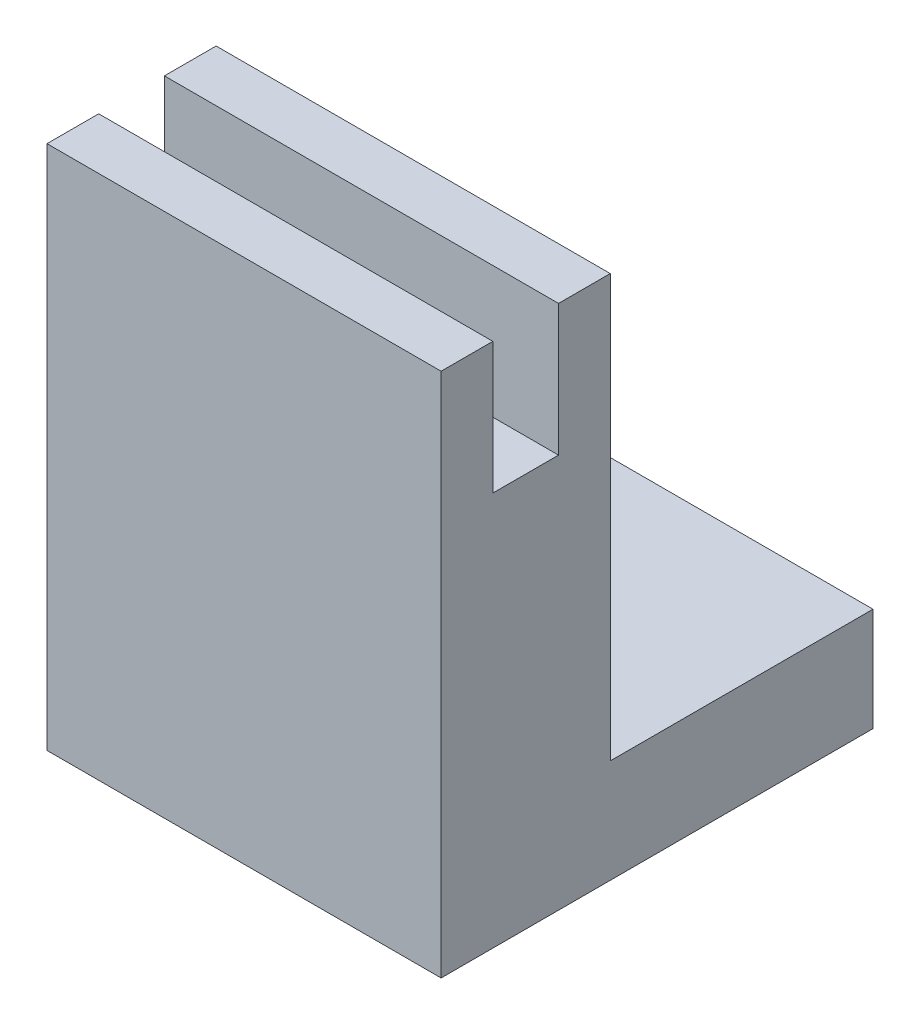
ISO-10303-21;
HEADER;
FILE_DESCRIPTION(('STEP AP214'),'2;1');
FILE_NAME('part.step','',(''),(''),'','','');
FILE_SCHEMA(('AUTOMOTIVE_DESIGN { 1 0 10303 214 1 1 1 1 }'));
ENDSEC;
DATA;
#1=APPLICATION_CONTEXT('core data for automotive mechanical design processes');
#2=APPLICATION_PROTOCOL_DEFINITION('international standard','automotive_design',2000,#1);
#3=PRODUCT_CONTEXT('',#1,'mechanical');
#4=PRODUCT('Part','Part','',(#3));
#5=PRODUCT_RELATED_PRODUCT_CATEGORY('part','',(#4));
#6=PRODUCT_DEFINITION_FORMATION('','',#4);
#7=PRODUCT_DEFINITION_CONTEXT('part definition',#1,'design');
#8=PRODUCT_DEFINITION('design','',#6,#7);
#9=PRODUCT_DEFINITION_SHAPE('','',#8);
#10=(LENGTH_UNIT() NAMED_UNIT(*) SI_UNIT(.MILLI.,.METRE.));
#11=(NAMED_UNIT(*) PLANE_ANGLE_UNIT() SI_UNIT($,.RADIAN.));
#12=(NAMED_UNIT(*) SI_UNIT($,.STERADIAN.) SOLID_ANGLE_UNIT());
#13=UNCERTAINTY_MEASURE_WITH_UNIT(LENGTH_MEASURE(1.E-05),#10,'distance_accuracy_value','');
#14=(GEOMETRIC_REPRESENTATION_CONTEXT(3) GLOBAL_UNCERTAINTY_ASSIGNED_CONTEXT((#13)) GLOBAL_UNIT_ASSIGNED_CONTEXT((#10,
#11,#12)) REPRESENTATION_CONTEXT('',''));
#15=CARTESIAN_POINT('',(0.,0.,0.));
#16=DIRECTION('',(0.,0.,1.));
#17=DIRECTION('',(1.,0.,0.));
#18=AXIS2_PLACEMENT_3D('',#15,#16,#17);
#19=CARTESIAN_POINT('',(38.1,50.8,0.));
#20=DIRECTION('',(0.,0.,-1.));
#21=DIRECTION('',(0.,1.,0.));
#22=AXIS2_PLACEMENT_3D('',#19,#20,#21);
#23=PLANE('',#22);
#24=DIRECTION('',(0.,-1.,0.));
#25=VECTOR('',#24,1.);
#26=CARTESIAN_POINT('',(0.,50.8,0.));
#27=LINE('',#26,#25);
#28=CARTESIAN_POINT('',(0.,50.8,0.));
#29=VERTEX_POINT('',#28);
#30=CARTESIAN_POINT('',(0.,0.,0.));
#31=VERTEX_POINT('',#30);
#32=EDGE_CURVE('E143',#29,#31,#27,.T.);
#33=ORIENTED_EDGE('',*,*,#32,.T.);
#34=DIRECTION('',(-1.,0.,0.));
#35=VECTOR('',#34,1.);
#36=CARTESIAN_POINT('',(38.1,0.,0.));
#37=LINE('',#36,#35);
#38=CARTESIAN_POINT('',(38.1,0.,0.));
#39=VERTEX_POINT('',#38);
#40=EDGE_CURVE('E11',#39,#31,#37,.T.);
#41=ORIENTED_EDGE('',*,*,#40,.F.);
#42=DIRECTION('',(0.,-1.,0.));
#43=VECTOR('',#42,1.);
#44=CARTESIAN_POINT('',(38.1,50.8,0.));
#45=LINE('',#44,#43);
#46=CARTESIAN_POINT('',(38.1,50.8,0.));
#47=VERTEX_POINT('',#46);
#48=EDGE_CURVE('E161',#47,#39,#45,.T.);
#49=ORIENTED_EDGE('',*,*,#48,.F.);
#50=DIRECTION('',(-1.,0.,0.));
#51=VECTOR('',#50,1.);
#52=CARTESIAN_POINT('',(38.1,50.8,0.));
#53=LINE('',#52,#51);
#54=EDGE_CURVE('E139',#47,#29,#53,.T.);
#55=ORIENTED_EDGE('',*,*,#54,.T.);
#56=EDGE_LOOP('',(#33,#41,#49,#55));
#57=FACE_BOUND('',#56,.T.);
#58=ADVANCED_FACE('F35',(#57),#23,.F.);
#59=CARTESIAN_POINT('',(38.1,0.,0.));
#60=DIRECTION('',(0.,1.,0.));
#61=DIRECTION('',(0.,0.,1.));
#62=AXIS2_PLACEMENT_3D('',#59,#60,#61);
#63=PLANE('',#62);
#64=DIRECTION('',(0.,0.,-1.));
#65=VECTOR('',#64,1.);
#66=CARTESIAN_POINT('',(0.,0.,0.));
#67=LINE('',#66,#65);
#68=CARTESIAN_POINT('',(0.,0.,-41.75));
#69=VERTEX_POINT('',#68);
#70=EDGE_CURVE('E146',#31,#69,#67,.T.);
#71=ORIENTED_EDGE('',*,*,#70,.T.);
#72=DIRECTION('',(-1.,0.,0.));
#73=VECTOR('',#72,1.);
#74=CARTESIAN_POINT('',(38.1,0.,-41.75));
#75=LINE('',#74,#73);
#76=CARTESIAN_POINT('',(38.1,0.,-41.75));
#77=VERTEX_POINT('',#76);
#78=EDGE_CURVE('E43',#77,#69,#75,.T.);
#79=ORIENTED_EDGE('',*,*,#78,.F.);
#80=DIRECTION('',(0.,0.,-1.));
#81=VECTOR('',#80,1.);
#82=CARTESIAN_POINT('',(38.1,0.,0.));
#83=LINE('',#82,#81);
#84=EDGE_CURVE('E100',#39,#77,#83,.T.);
#85=ORIENTED_EDGE('',*,*,#84,.F.);
#86=ORIENTED_EDGE('',*,*,#40,.T.);
#87=EDGE_LOOP('',(#71,#79,#85,#86));
#88=FACE_BOUND('',#87,.T.);
#89=ADVANCED_FACE('F210',(#88),#63,.F.);
#90=CARTESIAN_POINT('',(38.1,0.,-41.75));
#91=DIRECTION('',(0.,0.,1.));
#92=DIRECTION('',(1.,0.,0.));
#93=AXIS2_PLACEMENT_3D('',#90,#91,#92);
#94=PLANE('',#93);
#95=DIRECTION('',(0.,1.,0.));
#96=VECTOR('',#95,1.);
#97=CARTESIAN_POINT('',(0.,0.,-41.75));
#98=LINE('',#97,#96);
#99=CARTESIAN_POINT('',(0.,9.99999999999999,-41.75));
#100=VERTEX_POINT('',#99);
#101=EDGE_CURVE('E148',#69,#100,#98,.T.);
#102=ORIENTED_EDGE('',*,*,#101,.T.);
#103=DIRECTION('',(-1.,0.,0.));
#104=VECTOR('',#103,1.);
#105=CARTESIAN_POINT('',(38.1,9.99999999999999,-41.75));
#106=LINE('',#105,#104);
#107=CARTESIAN_POINT('',(38.1,9.99999999999999,-41.75));
#108=VERTEX_POINT('',#107);
#109=EDGE_CURVE('E174',#108,#100,#106,.T.);
#110=ORIENTED_EDGE('',*,*,#109,.F.);
#111=DIRECTION('',(0.,1.,0.));
#112=VECTOR('',#111,1.);
#113=CARTESIAN_POINT('',(38.1,0.,-41.75));
#114=LINE('',#113,#112);
#115=EDGE_CURVE('E182',#77,#108,#114,.T.);
#116=ORIENTED_EDGE('',*,*,#115,.F.);
#117=ORIENTED_EDGE('',*,*,#78,.T.);
#118=EDGE_LOOP('',(#102,#110,#116,#117));
#119=FACE_BOUND('',#118,.T.);
#120=ADVANCED_FACE('F180',(#119),#94,.F.);
#121=CARTESIAN_POINT('',(38.1,9.99999999999999,-41.75));
#122=DIRECTION('',(0.,-1.,0.));
#123=DIRECTION('',(0.,0.,-1.));
#124=AXIS2_PLACEMENT_3D('',#121,#122,#123);
#125=PLANE('',#124);
#126=DIRECTION('',(0.,0.,1.));
#127=VECTOR('',#126,1.);
#128=CARTESIAN_POINT('',(0.,9.99999999999999,-41.75));
#129=LINE('',#128,#127);
#130=CARTESIAN_POINT('',(0.,9.99999999999999,-16.35));
#131=VERTEX_POINT('',#130);
#132=EDGE_CURVE('E150',#100,#131,#129,.T.);
#133=ORIENTED_EDGE('',*,*,#132,.T.);
#134=DIRECTION('',(-1.,0.,0.));
#135=VECTOR('',#134,1.);
#136=CARTESIAN_POINT('',(38.1,9.99999999999999,-16.35));
#137=LINE('',#136,#135);
#138=CARTESIAN_POINT('',(38.1,9.99999999999999,-16.35));
#139=VERTEX_POINT('',#138);
#140=EDGE_CURVE('E171',#139,#131,#137,.T.);
#141=ORIENTED_EDGE('',*,*,#140,.F.);
#142=DIRECTION('',(0.,0.,1.));
#143=VECTOR('',#142,1.);
#144=CARTESIAN_POINT('',(38.1,9.99999999999999,-41.75));
#145=LINE('',#144,#143);
#146=EDGE_CURVE('E200',#108,#139,#145,.T.);
#147=ORIENTED_EDGE('',*,*,#146,.F.);
#148=ORIENTED_EDGE('',*,*,#109,.T.);
#149=EDGE_LOOP('',(#133,#141,#147,#148));
#150=FACE_BOUND('',#149,.T.);
#151=ADVANCED_FACE('F191',(#150),#125,.F.);
#152=CARTESIAN_POINT('',(38.1,9.99999999999999,-16.35));
#153=DIRECTION('',(0.,0.,1.));
#154=DIRECTION('',(1.,0.,0.));
#155=AXIS2_PLACEMENT_3D('',#152,#153,#154);
#156=PLANE('',#155);
#157=DIRECTION('',(0.,1.,0.));
#158=VECTOR('',#157,1.);
#159=CARTESIAN_POINT('',(0.,9.99999999999999,-16.35));
#160=LINE('',#159,#158);
#161=CARTESIAN_POINT('',(0.,50.8,-16.35));
#162=VERTEX_POINT('',#161);
#163=EDGE_CURVE('E152',#131,#162,#160,.T.);
#164=ORIENTED_EDGE('',*,*,#163,.T.);
#165=DIRECTION('',(-1.,0.,0.));
#166=VECTOR('',#165,1.);
#167=CARTESIAN_POINT('',(38.1,50.8,-16.35));
#168=LINE('',#167,#166);
#169=CARTESIAN_POINT('',(38.1,50.8,-16.35));
#170=VERTEX_POINT('',#169);
#171=EDGE_CURVE('E168',#170,#162,#168,.T.);
#172=ORIENTED_EDGE('',*,*,#171,.F.);
#173=DIRECTION('',(0.,1.,0.));
#174=VECTOR('',#173,1.);
#175=CARTESIAN_POINT('',(38.1,9.99999999999999,-16.35));
#176=LINE('',#175,#174);
#177=EDGE_CURVE('E197',#139,#170,#176,.T.);
#178=ORIENTED_EDGE('',*,*,#177,.F.);
#179=ORIENTED_EDGE('',*,*,#140,.T.);
#180=EDGE_LOOP('',(#164,#172,#178,#179));
#181=FACE_BOUND('',#180,.T.);
#182=ADVANCED_FACE('F195',(#181),#156,.F.);
#183=CARTESIAN_POINT('',(38.1,50.8,-16.35));
#184=DIRECTION('',(0.,-1.,0.));
#185=DIRECTION('',(0.,0.,-1.));
#186=AXIS2_PLACEMENT_3D('',#183,#184,#185);
#187=PLANE('',#186);
#188=DIRECTION('',(0.,0.,1.));
#189=VECTOR('',#188,1.);
#190=CARTESIAN_POINT('',(0.,50.8,-16.35));
#191=LINE('',#190,#189);
#192=CARTESIAN_POINT('',(0.,50.8,-11.35));
#193=VERTEX_POINT('',#192);
#194=EDGE_CURVE('E154',#162,#193,#191,.T.);
#195=ORIENTED_EDGE('',*,*,#194,.T.);
#196=DIRECTION('',(-1.,0.,0.));
#197=VECTOR('',#196,1.);
#198=CARTESIAN_POINT('',(38.1,50.8,-11.35));
#199=LINE('',#198,#197);
#200=CARTESIAN_POINT('',(38.1,50.8,-11.35));
#201=VERTEX_POINT('',#200);
#202=EDGE_CURVE('E165',#201,#193,#199,.T.);
#203=ORIENTED_EDGE('',*,*,#202,.F.);
#204=DIRECTION('',(0.,0.,1.));
#205=VECTOR('',#204,1.);
#206=CARTESIAN_POINT('',(38.1,50.8,-16.35));
#207=LINE('',#206,#205);
#208=EDGE_CURVE('E199',#170,#201,#207,.T.);
#209=ORIENTED_EDGE('',*,*,#208,.F.);
#210=ORIENTED_EDGE('',*,*,#171,.T.);
#211=EDGE_LOOP('',(#195,#203,#209,#210));
#212=FACE_BOUND('',#211,.T.);
#213=ADVANCED_FACE('F222',(#212),#187,.F.);
#214=CARTESIAN_POINT('',(38.1,50.8,-11.35));
#215=DIRECTION('',(0.,0.,-1.));
#216=DIRECTION('',(0.,1.,0.));
#217=AXIS2_PLACEMENT_3D('',#214,#215,#216);
#218=PLANE('',#217);
#219=DIRECTION('',(0.,-1.,0.));
#220=VECTOR('',#219,1.);
#221=CARTESIAN_POINT('',(0.,50.8,-11.35));
#222=LINE('',#221,#220);
#223=CARTESIAN_POINT('',(0.,38.1,-11.35));
#224=VERTEX_POINT('',#223);
#225=EDGE_CURVE('E156',#193,#224,#222,.T.);
#226=ORIENTED_EDGE('',*,*,#225,.T.);
#227=DIRECTION('',(-1.,0.,0.));
#228=VECTOR('',#227,1.);
#229=CARTESIAN_POINT('',(38.1,38.1,-11.35));
#230=LINE('',#229,#228);
#231=CARTESIAN_POINT('',(38.1,38.1,-11.35));
#232=VERTEX_POINT('',#231);
#233=EDGE_CURVE('E134',#232,#224,#230,.T.);
#234=ORIENTED_EDGE('',*,*,#233,.F.);
#235=DIRECTION('',(0.,-1.,0.));
#236=VECTOR('',#235,1.);
#237=CARTESIAN_POINT('',(38.1,50.8,-11.35));
#238=LINE('',#237,#236);
#239=EDGE_CURVE('E125',#201,#232,#238,.T.);
#240=ORIENTED_EDGE('',*,*,#239,.F.);
#241=ORIENTED_EDGE('',*,*,#202,.T.);
#242=EDGE_LOOP('',(#226,#234,#240,#241));
#243=FACE_BOUND('',#242,.T.);
#244=ADVANCED_FACE('F225',(#243),#218,.F.);
#245=CARTESIAN_POINT('',(38.1,38.1,-11.35));
#246=DIRECTION('',(0.,-1.,0.));
#247=DIRECTION('',(0.,0.,-1.));
#248=AXIS2_PLACEMENT_3D('',#245,#246,#247);
#249=PLANE('',#248);
#250=DIRECTION('',(0.,0.,1.));
#251=VECTOR('',#250,1.);
#252=CARTESIAN_POINT('',(0.,38.1,-11.35));
#253=LINE('',#252,#251);
#254=CARTESIAN_POINT('',(0.,38.1,-4.99999999999999));
#255=VERTEX_POINT('',#254);
#256=EDGE_CURVE('E133',#224,#255,#253,.T.);
#257=ORIENTED_EDGE('',*,*,#256,.T.);
#258=DIRECTION('',(-1.,0.,0.));
#259=VECTOR('',#258,1.);
#260=CARTESIAN_POINT('',(38.1,38.1,-4.99999999999999));
#261=LINE('',#260,#259);
#262=CARTESIAN_POINT('',(38.1,38.1,-4.99999999999999));
#263=VERTEX_POINT('',#262);
#264=EDGE_CURVE('E130',#263,#255,#261,.T.);
#265=ORIENTED_EDGE('',*,*,#264,.F.);
#266=DIRECTION('',(0.,0.,1.));
#267=VECTOR('',#266,1.);
#268=CARTESIAN_POINT('',(38.1,38.1,-11.35));
#269=LINE('',#268,#267);
#270=EDGE_CURVE('E119',#232,#263,#269,.T.);
#271=ORIENTED_EDGE('',*,*,#270,.F.);
#272=ORIENTED_EDGE('',*,*,#233,.T.);
#273=EDGE_LOOP('',(#257,#265,#271,#272));
#274=FACE_BOUND('',#273,.T.);
#275=ADVANCED_FACE('F131',(#274),#249,.F.);
#276=CARTESIAN_POINT('',(38.1,38.1,-4.99999999999999));
#277=DIRECTION('',(0.,0.,1.));
#278=DIRECTION('',(0.,-1.,0.));
#279=AXIS2_PLACEMENT_3D('',#276,#277,#278);
#280=PLANE('',#279);
#281=DIRECTION('',(0.,1.,0.));
#282=VECTOR('',#281,1.);
#283=CARTESIAN_POINT('',(0.,38.1,-4.99999999999999));
#284=LINE('',#283,#282);
#285=CARTESIAN_POINT('',(0.,50.8,-4.99999999999999));
#286=VERTEX_POINT('',#285);
#287=EDGE_CURVE('E86',#255,#286,#284,.T.);
#288=ORIENTED_EDGE('',*,*,#287,.T.);
#289=DIRECTION('',(-1.,0.,0.));
#290=VECTOR('',#289,1.);
#291=CARTESIAN_POINT('',(38.1,50.8,-4.99999999999999));
#292=LINE('',#291,#290);
#293=CARTESIAN_POINT('',(38.1,50.8,-4.99999999999999));
#294=VERTEX_POINT('',#293);
#295=EDGE_CURVE('E135',#294,#286,#292,.T.);
#296=ORIENTED_EDGE('',*,*,#295,.F.);
#297=DIRECTION('',(0.,1.,0.));
#298=VECTOR('',#297,1.);
#299=CARTESIAN_POINT('',(38.1,38.1,-4.99999999999999));
#300=LINE('',#299,#298);
#301=EDGE_CURVE('E123',#263,#294,#300,.T.);
#302=ORIENTED_EDGE('',*,*,#301,.F.);
#303=ORIENTED_EDGE('',*,*,#264,.T.);
#304=EDGE_LOOP('',(#288,#296,#302,#303));
#305=FACE_BOUND('',#304,.T.);
#306=ADVANCED_FACE('F137',(#305),#280,.F.);
#307=CARTESIAN_POINT('',(38.1,50.8,-4.99999999999999));
#308=DIRECTION('',(0.,-1.,0.));
#309=DIRECTION('',(0.,0.,-1.));
#310=AXIS2_PLACEMENT_3D('',#307,#308,#309);
#311=PLANE('',#310);
#312=DIRECTION('',(0.,0.,1.));
#313=VECTOR('',#312,1.);
#314=CARTESIAN_POINT('',(0.,50.8,-4.99999999999999));
#315=LINE('',#314,#313);
#316=EDGE_CURVE('E92',#286,#29,#315,.T.);
#317=ORIENTED_EDGE('',*,*,#316,.T.);
#318=ORIENTED_EDGE('',*,*,#54,.F.);
#319=DIRECTION('',(0.,0.,1.));
#320=VECTOR('',#319,1.);
#321=CARTESIAN_POINT('',(38.1,50.8,-4.99999999999999));
#322=LINE('',#321,#320);
#323=EDGE_CURVE('E51',#294,#47,#322,.T.);
#324=ORIENTED_EDGE('',*,*,#323,.F.);
#325=ORIENTED_EDGE('',*,*,#295,.T.);
#326=EDGE_LOOP('',(#317,#318,#324,#325));
#327=FACE_BOUND('',#326,.T.);
#328=ADVANCED_FACE('F234',(#327),#311,.F.);
#329=CARTESIAN_POINT('',(38.1,0.,0.));
#330=DIRECTION('',(1.,0.,0.));
#331=DIRECTION('',(0.,0.,-1.));
#332=AXIS2_PLACEMENT_3D('',#329,#330,#331);
#333=PLANE('',#332);
#334=ORIENTED_EDGE('',*,*,#48,.T.);
#335=ORIENTED_EDGE('',*,*,#84,.T.);
#336=ORIENTED_EDGE('',*,*,#115,.T.);
#337=ORIENTED_EDGE('',*,*,#146,.T.);
#338=ORIENTED_EDGE('',*,*,#177,.T.);
#339=ORIENTED_EDGE('',*,*,#208,.T.);
#340=ORIENTED_EDGE('',*,*,#239,.T.);
#341=ORIENTED_EDGE('',*,*,#270,.T.);
#342=ORIENTED_EDGE('',*,*,#301,.T.);
#343=ORIENTED_EDGE('',*,*,#323,.T.);
#344=EDGE_LOOP('',(#334,#335,#336,#337,#338,#339,#340,#341,#342,#343));
#345=FACE_BOUND('',#344,.T.);
#346=ADVANCED_FACE('F121',(#345),#333,.T.);
#347=CARTESIAN_POINT('',(0.,0.,0.));
#348=DIRECTION('',(1.,0.,0.));
#349=DIRECTION('',(0.,0.,-1.));
#350=AXIS2_PLACEMENT_3D('',#347,#348,#349);
#351=PLANE('',#350);
#352=ORIENTED_EDGE('',*,*,#32,.F.);
#353=ORIENTED_EDGE('',*,*,#316,.F.);
#354=ORIENTED_EDGE('',*,*,#287,.F.);
#355=ORIENTED_EDGE('',*,*,#256,.F.);
#356=ORIENTED_EDGE('',*,*,#225,.F.);
#357=ORIENTED_EDGE('',*,*,#194,.F.);
#358=ORIENTED_EDGE('',*,*,#163,.F.);
#359=ORIENTED_EDGE('',*,*,#132,.F.);
#360=ORIENTED_EDGE('',*,*,#101,.F.);
#361=ORIENTED_EDGE('',*,*,#70,.F.);
#362=EDGE_LOOP('',(#352,#353,#354,#355,#356,#357,#358,#359,#360,#361));
#363=FACE_BOUND('',#362,.T.);
#364=ADVANCED_FACE('F186',(#363),#351,.F.);
#365=CLOSED_SHELL('',(#58,#89,#120,#151,#182,#213,#244,#275,#306,#328,#346,#364));
#366=MANIFOLD_SOLID_BREP('B2',#365);
#367=ADVANCED_BREP_SHAPE_REPRESENTATION('',(#18,#366),#14);
#368=SHAPE_DEFINITION_REPRESENTATION(#9,#367);
ENDSEC;
END-ISO-10303-21;
